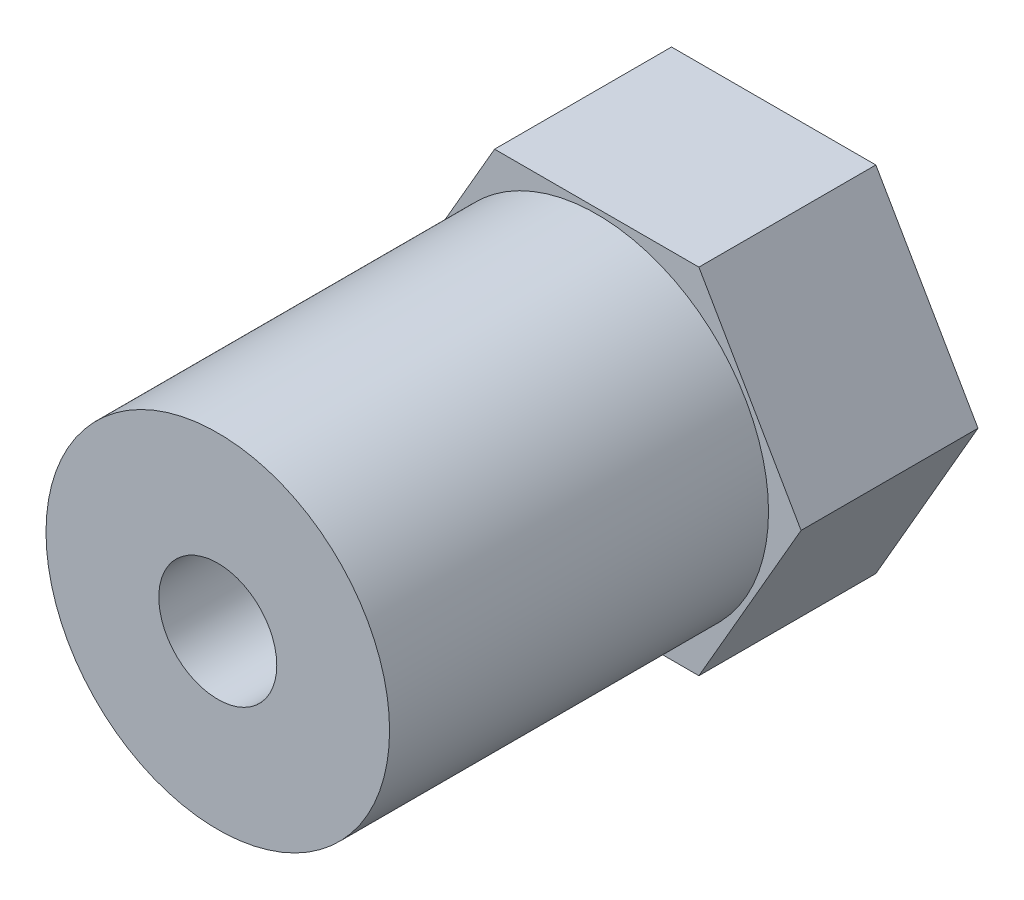
ISO-10303-21;
HEADER;
FILE_DESCRIPTION(('STEP AP214'),'2;1');
FILE_NAME('part.step','',(''),(''),'','','');
FILE_SCHEMA(('AUTOMOTIVE_DESIGN { 1 0 10303 214 1 1 1 1 }'));
ENDSEC;
DATA;
#1=APPLICATION_CONTEXT('core data for automotive mechanical design processes');
#2=APPLICATION_PROTOCOL_DEFINITION('international standard','automotive_design',2000,#1);
#3=PRODUCT_CONTEXT('',#1,'mechanical');
#4=PRODUCT('Part','Part','',(#3));
#5=PRODUCT_RELATED_PRODUCT_CATEGORY('part','',(#4));
#6=PRODUCT_DEFINITION_FORMATION('','',#4);
#7=PRODUCT_DEFINITION_CONTEXT('part definition',#1,'design');
#8=PRODUCT_DEFINITION('design','',#6,#7);
#9=PRODUCT_DEFINITION_SHAPE('','',#8);
#10=(LENGTH_UNIT() NAMED_UNIT(*) SI_UNIT(.MILLI.,.METRE.));
#11=(NAMED_UNIT(*) PLANE_ANGLE_UNIT() SI_UNIT($,.RADIAN.));
#12=(NAMED_UNIT(*) SI_UNIT($,.STERADIAN.) SOLID_ANGLE_UNIT());
#13=UNCERTAINTY_MEASURE_WITH_UNIT(LENGTH_MEASURE(1.E-05),#10,'distance_accuracy_value','');
#14=(GEOMETRIC_REPRESENTATION_CONTEXT(3) GLOBAL_UNCERTAINTY_ASSIGNED_CONTEXT((#13)) GLOBAL_UNIT_ASSIGNED_CONTEXT((#10,
#11,#12)) REPRESENTATION_CONTEXT('',''));
#15=CARTESIAN_POINT('',(0.,0.,0.));
#16=DIRECTION('',(0.,0.,1.));
#17=DIRECTION('',(1.,0.,0.));
#18=AXIS2_PLACEMENT_3D('',#15,#16,#17);
#19=CARTESIAN_POINT('',(0.,0.,6.));
#20=DIRECTION('',(0.,0.,1.));
#21=DIRECTION('',(1.,0.,0.));
#22=AXIS2_PLACEMENT_3D('',#19,#20,#21);
#23=PLANE('',#22);
#24=CARTESIAN_POINT('',(0.,0.,6.));
#25=DIRECTION('',(0.,0.,1.));
#26=DIRECTION('',(1.,0.,0.));
#27=AXIS2_PLACEMENT_3D('',#24,#25,#26);
#28=CIRCLE('',#27,1.625);
#29=CARTESIAN_POINT('',(1.625,0.,6.));
#30=VERTEX_POINT('',#29);
#31=EDGE_CURVE('E130',#30,#30,#28,.T.);
#32=ORIENTED_EDGE('',*,*,#31,.F.);
#33=EDGE_LOOP('',(#32));
#34=FACE_BOUND('',#33,.T.);
#35=CARTESIAN_POINT('',(0.,0.,6.));
#36=DIRECTION('',(0.,0.,1.));
#37=DIRECTION('',(1.,0.,0.));
#38=AXIS2_PLACEMENT_3D('',#35,#36,#37);
#39=CIRCLE('',#38,2.);
#40=CARTESIAN_POINT('',(2.,0.,6.));
#41=VERTEX_POINT('',#40);
#42=EDGE_CURVE('E165',#41,#41,#39,.T.);
#43=ORIENTED_EDGE('',*,*,#42,.T.);
#44=EDGE_LOOP('',(#43));
#45=FACE_BOUND('',#44,.T.);
#46=ADVANCED_FACE('F39',(#34,#45),#23,.T.);
#47=CARTESIAN_POINT('',(0.,0.,6.));
#48=DIRECTION('',(0.,0.,1.));
#49=DIRECTION('',(1.,0.,0.));
#50=AXIS2_PLACEMENT_3D('',#47,#48,#49);
#51=CIRCLE('',#50,5.825);
#52=CARTESIAN_POINT('',(5.825,0.,6.));
#53=VERTEX_POINT('',#52);
#54=EDGE_CURVE('E11',#53,#53,#51,.T.);
#55=ORIENTED_EDGE('',*,*,#54,.F.);
#56=EDGE_LOOP('',(#55));
#57=FACE_BOUND('',#56,.T.);
#58=DIRECTION('',(0.5,0.866025403784439,0.));
#59=VECTOR('',#58,1.);
#60=CARTESIAN_POINT('',(3.46410161513776,-6.,6.));
#61=LINE('',#60,#59);
#62=CARTESIAN_POINT('',(3.46410161513776,-6.,6.));
#63=VERTEX_POINT('',#62);
#64=CARTESIAN_POINT('',(6.92820323027551,0.,6.));
#65=VERTEX_POINT('',#64);
#66=EDGE_CURVE('E137',#63,#65,#61,.T.);
#67=ORIENTED_EDGE('',*,*,#66,.T.);
#68=DIRECTION('',(-0.5,0.866025403784438,0.));
#69=VECTOR('',#68,1.);
#70=CARTESIAN_POINT('',(6.92820323027551,0.,6.));
#71=LINE('',#70,#69);
#72=CARTESIAN_POINT('',(3.46410161513775,6.,6.));
#73=VERTEX_POINT('',#72);
#74=EDGE_CURVE('E95',#65,#73,#71,.T.);
#75=ORIENTED_EDGE('',*,*,#74,.T.);
#76=DIRECTION('',(-1.,0.,0.));
#77=VECTOR('',#76,1.);
#78=CARTESIAN_POINT('',(3.46410161513775,6.,6.));
#79=LINE('',#78,#77);
#80=CARTESIAN_POINT('',(-3.46410161513776,6.,6.));
#81=VERTEX_POINT('',#80);
#82=EDGE_CURVE('E108',#73,#81,#79,.T.);
#83=ORIENTED_EDGE('',*,*,#82,.T.);
#84=DIRECTION('',(-0.5,-0.866025403784439,0.));
#85=VECTOR('',#84,1.);
#86=CARTESIAN_POINT('',(-3.46410161513776,6.,6.));
#87=LINE('',#86,#85);
#88=CARTESIAN_POINT('',(-6.92820323027551,0.,6.));
#89=VERTEX_POINT('',#88);
#90=EDGE_CURVE('E102',#81,#89,#87,.T.);
#91=ORIENTED_EDGE('',*,*,#90,.T.);
#92=DIRECTION('',(0.5,-0.866025403784439,0.));
#93=VECTOR('',#92,1.);
#94=CARTESIAN_POINT('',(-6.92820323027551,0.,6.));
#95=LINE('',#94,#93);
#96=CARTESIAN_POINT('',(-3.46410161513776,-6.,6.));
#97=VERTEX_POINT('',#96);
#98=EDGE_CURVE('E106',#89,#97,#95,.T.);
#99=ORIENTED_EDGE('',*,*,#98,.T.);
#100=DIRECTION('',(1.,0.,0.));
#101=VECTOR('',#100,1.);
#102=CARTESIAN_POINT('',(-3.46410161513776,-6.,6.));
#103=LINE('',#102,#101);
#104=EDGE_CURVE('E57',#97,#63,#103,.T.);
#105=ORIENTED_EDGE('',*,*,#104,.T.);
#106=EDGE_LOOP('',(#67,#75,#83,#91,#99,#105));
#107=FACE_BOUND('',#106,.T.);
#108=ADVANCED_FACE('F104',(#57,#107),#23,.T.);
#109=CARTESIAN_POINT('',(0.,0.,0.));
#110=DIRECTION('',(0.,0.,1.));
#111=DIRECTION('',(1.,0.,0.));
#112=AXIS2_PLACEMENT_3D('',#109,#110,#111);
#113=PLANE('',#112);
#114=DIRECTION('',(0.5,0.866025403784439,0.));
#115=VECTOR('',#114,1.);
#116=CARTESIAN_POINT('',(3.46410161513776,-6.,0.));
#117=LINE('',#116,#115);
#118=CARTESIAN_POINT('',(3.46410161513776,-6.,0.));
#119=VERTEX_POINT('',#118);
#120=CARTESIAN_POINT('',(6.92820323027551,0.,0.));
#121=VERTEX_POINT('',#120);
#122=EDGE_CURVE('E126',#119,#121,#117,.T.);
#123=ORIENTED_EDGE('',*,*,#122,.F.);
#124=DIRECTION('',(1.,0.,0.));
#125=VECTOR('',#124,1.);
#126=CARTESIAN_POINT('',(-3.46410161513776,-6.,0.));
#127=LINE('',#126,#125);
#128=CARTESIAN_POINT('',(-3.46410161513776,-6.,0.));
#129=VERTEX_POINT('',#128);
#130=EDGE_CURVE('E86',#129,#119,#127,.T.);
#131=ORIENTED_EDGE('',*,*,#130,.F.);
#132=DIRECTION('',(0.5,-0.866025403784439,0.));
#133=VECTOR('',#132,1.);
#134=CARTESIAN_POINT('',(-6.92820323027551,0.,0.));
#135=LINE('',#134,#133);
#136=CARTESIAN_POINT('',(-6.92820323027551,0.,0.));
#137=VERTEX_POINT('',#136);
#138=EDGE_CURVE('E80',#137,#129,#135,.T.);
#139=ORIENTED_EDGE('',*,*,#138,.F.);
#140=DIRECTION('',(-0.5,-0.866025403784439,0.));
#141=VECTOR('',#140,1.);
#142=CARTESIAN_POINT('',(-3.46410161513776,6.,0.));
#143=LINE('',#142,#141);
#144=CARTESIAN_POINT('',(-3.46410161513776,6.,0.));
#145=VERTEX_POINT('',#144);
#146=EDGE_CURVE('E116',#145,#137,#143,.T.);
#147=ORIENTED_EDGE('',*,*,#146,.F.);
#148=DIRECTION('',(-1.,0.,0.));
#149=VECTOR('',#148,1.);
#150=CARTESIAN_POINT('',(3.46410161513775,6.,0.));
#151=LINE('',#150,#149);
#152=CARTESIAN_POINT('',(3.46410161513775,6.,0.));
#153=VERTEX_POINT('',#152);
#154=EDGE_CURVE('E132',#153,#145,#151,.T.);
#155=ORIENTED_EDGE('',*,*,#154,.F.);
#156=DIRECTION('',(-0.5,0.866025403784438,0.));
#157=VECTOR('',#156,1.);
#158=CARTESIAN_POINT('',(6.92820323027551,0.,0.));
#159=LINE('',#158,#157);
#160=EDGE_CURVE('E129',#121,#153,#159,.T.);
#161=ORIENTED_EDGE('',*,*,#160,.F.);
#162=EDGE_LOOP('',(#123,#131,#139,#147,#155,#161));
#163=FACE_BOUND('',#162,.T.);
#164=CARTESIAN_POINT('',(0.,0.,0.));
#165=DIRECTION('',(0.,0.,1.));
#166=DIRECTION('',(1.,0.,0.));
#167=AXIS2_PLACEMENT_3D('',#164,#165,#166);
#168=CIRCLE('',#167,1.625);
#169=CARTESIAN_POINT('',(1.625,0.,0.));
#170=VERTEX_POINT('',#169);
#171=EDGE_CURVE('E156',#170,#170,#168,.T.);
#172=ORIENTED_EDGE('',*,*,#171,.T.);
#173=EDGE_LOOP('',(#172));
#174=FACE_BOUND('',#173,.T.);
#175=ADVANCED_FACE('F150',(#163,#174),#113,.F.);
#176=CARTESIAN_POINT('',(3.46410161513776,-6.,6.));
#177=DIRECTION('',(-0.866025403784439,0.5,0.));
#178=DIRECTION('',(-0.5,-0.866025403784439,0.));
#179=AXIS2_PLACEMENT_3D('',#176,#177,#178);
#180=PLANE('',#179);
#181=ORIENTED_EDGE('',*,*,#122,.T.);
#182=DIRECTION('',(0.,0.,-1.));
#183=VECTOR('',#182,1.);
#184=CARTESIAN_POINT('',(6.92820323027551,0.,6.));
#185=LINE('',#184,#183);
#186=EDGE_CURVE('E43',#65,#121,#185,.T.);
#187=ORIENTED_EDGE('',*,*,#186,.F.);
#188=ORIENTED_EDGE('',*,*,#66,.F.);
#189=DIRECTION('',(0.,0.,-1.));
#190=VECTOR('',#189,1.);
#191=CARTESIAN_POINT('',(3.46410161513776,-6.,6.));
#192=LINE('',#191,#190);
#193=EDGE_CURVE('E122',#63,#119,#192,.T.);
#194=ORIENTED_EDGE('',*,*,#193,.T.);
#195=EDGE_LOOP('',(#181,#187,#188,#194));
#196=FACE_BOUND('',#195,.T.);
#197=ADVANCED_FACE('F41',(#196),#180,.F.);
#198=CARTESIAN_POINT('',(6.92820323027551,0.,6.));
#199=DIRECTION('',(-0.866025403784438,-0.5,0.));
#200=DIRECTION('',(0.5,-0.866025403784438,0.));
#201=AXIS2_PLACEMENT_3D('',#198,#199,#200);
#202=PLANE('',#201);
#203=ORIENTED_EDGE('',*,*,#160,.T.);
#204=DIRECTION('',(0.,0.,-1.));
#205=VECTOR('',#204,1.);
#206=CARTESIAN_POINT('',(3.46410161513775,6.,6.));
#207=LINE('',#206,#205);
#208=EDGE_CURVE('E140',#73,#153,#207,.T.);
#209=ORIENTED_EDGE('',*,*,#208,.F.);
#210=ORIENTED_EDGE('',*,*,#74,.F.);
#211=ORIENTED_EDGE('',*,*,#186,.T.);
#212=EDGE_LOOP('',(#203,#209,#210,#211));
#213=FACE_BOUND('',#212,.T.);
#214=ADVANCED_FACE('F145',(#213),#202,.F.);
#215=CARTESIAN_POINT('',(3.46410161513775,6.,6.));
#216=DIRECTION('',(0.,-1.,0.));
#217=DIRECTION('',(0.,0.,-1.));
#218=AXIS2_PLACEMENT_3D('',#215,#216,#217);
#219=PLANE('',#218);
#220=ORIENTED_EDGE('',*,*,#154,.T.);
#221=DIRECTION('',(0.,0.,-1.));
#222=VECTOR('',#221,1.);
#223=CARTESIAN_POINT('',(-3.46410161513776,6.,6.));
#224=LINE('',#223,#222);
#225=EDGE_CURVE('E117',#81,#145,#224,.T.);
#226=ORIENTED_EDGE('',*,*,#225,.F.);
#227=ORIENTED_EDGE('',*,*,#82,.F.);
#228=ORIENTED_EDGE('',*,*,#208,.T.);
#229=EDGE_LOOP('',(#220,#226,#227,#228));
#230=FACE_BOUND('',#229,.T.);
#231=ADVANCED_FACE('F152',(#230),#219,.F.);
#232=CARTESIAN_POINT('',(-3.46410161513776,6.,6.));
#233=DIRECTION('',(0.866025403784439,-0.5,0.));
#234=DIRECTION('',(0.5,0.866025403784439,0.));
#235=AXIS2_PLACEMENT_3D('',#232,#233,#234);
#236=PLANE('',#235);
#237=ORIENTED_EDGE('',*,*,#146,.T.);
#238=DIRECTION('',(0.,0.,-1.));
#239=VECTOR('',#238,1.);
#240=CARTESIAN_POINT('',(-6.92820323027551,0.,6.));
#241=LINE('',#240,#239);
#242=EDGE_CURVE('E113',#89,#137,#241,.T.);
#243=ORIENTED_EDGE('',*,*,#242,.F.);
#244=ORIENTED_EDGE('',*,*,#90,.F.);
#245=ORIENTED_EDGE('',*,*,#225,.T.);
#246=EDGE_LOOP('',(#237,#243,#244,#245));
#247=FACE_BOUND('',#246,.T.);
#248=ADVANCED_FACE('F114',(#247),#236,.F.);
#249=CARTESIAN_POINT('',(-6.92820323027551,0.,6.));
#250=DIRECTION('',(0.866025403784439,0.5,0.));
#251=DIRECTION('',(-0.5,0.866025403784439,0.));
#252=AXIS2_PLACEMENT_3D('',#249,#250,#251);
#253=PLANE('',#252);
#254=ORIENTED_EDGE('',*,*,#138,.T.);
#255=DIRECTION('',(0.,0.,-1.));
#256=VECTOR('',#255,1.);
#257=CARTESIAN_POINT('',(-3.46410161513776,-6.,6.));
#258=LINE('',#257,#256);
#259=EDGE_CURVE('E118',#97,#129,#258,.T.);
#260=ORIENTED_EDGE('',*,*,#259,.F.);
#261=ORIENTED_EDGE('',*,*,#98,.F.);
#262=ORIENTED_EDGE('',*,*,#242,.T.);
#263=EDGE_LOOP('',(#254,#260,#261,#262));
#264=FACE_BOUND('',#263,.T.);
#265=ADVANCED_FACE('F120',(#264),#253,.F.);
#266=CARTESIAN_POINT('',(-3.46410161513776,-6.,6.));
#267=DIRECTION('',(0.,1.,0.));
#268=DIRECTION('',(0.,0.,1.));
#269=AXIS2_PLACEMENT_3D('',#266,#267,#268);
#270=PLANE('',#269);
#271=ORIENTED_EDGE('',*,*,#130,.T.);
#272=ORIENTED_EDGE('',*,*,#193,.F.);
#273=ORIENTED_EDGE('',*,*,#104,.F.);
#274=ORIENTED_EDGE('',*,*,#259,.T.);
#275=EDGE_LOOP('',(#271,#272,#273,#274));
#276=FACE_BOUND('',#275,.T.);
#277=ADVANCED_FACE('F186',(#276),#270,.F.);
#278=CARTESIAN_POINT('',(0.,0.,6.));
#279=DIRECTION('',(0.,0.,-1.));
#280=DIRECTION('',(-1.,0.,0.));
#281=AXIS2_PLACEMENT_3D('',#278,#279,#280);
#282=CYLINDRICAL_SURFACE('',#281,1.625);
#283=ORIENTED_EDGE('',*,*,#31,.T.);
#284=EDGE_LOOP('',(#283));
#285=FACE_BOUND('',#284,.T.);
#286=ORIENTED_EDGE('',*,*,#171,.F.);
#287=EDGE_LOOP('',(#286));
#288=FACE_BOUND('',#287,.T.);
#289=ADVANCED_FACE('F177',(#285,#288),#282,.F.);
#290=CARTESIAN_POINT('',(0.,0.,18.85));
#291=DIRECTION('',(0.,0.,1.));
#292=DIRECTION('',(1.,0.,0.));
#293=AXIS2_PLACEMENT_3D('',#290,#291,#292);
#294=PLANE('',#293);
#295=CARTESIAN_POINT('',(0.,0.,18.85));
#296=DIRECTION('',(0.,0.,1.));
#297=DIRECTION('',(1.,0.,0.));
#298=AXIS2_PLACEMENT_3D('',#295,#296,#297);
#299=CIRCLE('',#298,5.825);
#300=CARTESIAN_POINT('',(5.825,0.,18.85));
#301=VERTEX_POINT('',#300);
#302=EDGE_CURVE('E159',#301,#301,#299,.T.);
#303=ORIENTED_EDGE('',*,*,#302,.T.);
#304=EDGE_LOOP('',(#303));
#305=FACE_BOUND('',#304,.T.);
#306=CARTESIAN_POINT('',(0.,0.,18.85));
#307=DIRECTION('',(0.,0.,1.));
#308=DIRECTION('',(1.,0.,0.));
#309=AXIS2_PLACEMENT_3D('',#306,#307,#308);
#310=CIRCLE('',#309,2.);
#311=CARTESIAN_POINT('',(2.,0.,18.85));
#312=VERTEX_POINT('',#311);
#313=EDGE_CURVE('E164',#312,#312,#310,.T.);
#314=ORIENTED_EDGE('',*,*,#313,.F.);
#315=EDGE_LOOP('',(#314));
#316=FACE_BOUND('',#315,.T.);
#317=ADVANCED_FACE('F174',(#305,#316),#294,.T.);
#318=CARTESIAN_POINT('',(0.,0.,18.85));
#319=DIRECTION('',(0.,0.,-1.));
#320=DIRECTION('',(-1.,0.,0.));
#321=AXIS2_PLACEMENT_3D('',#318,#319,#320);
#322=CYLINDRICAL_SURFACE('',#321,5.825);
#323=ORIENTED_EDGE('',*,*,#302,.F.);
#324=EDGE_LOOP('',(#323));
#325=FACE_BOUND('',#324,.T.);
#326=ORIENTED_EDGE('',*,*,#54,.T.);
#327=EDGE_LOOP('',(#326));
#328=FACE_BOUND('',#327,.T.);
#329=ADVANCED_FACE('F176',(#325,#328),#322,.T.);
#330=CARTESIAN_POINT('',(0.,0.,18.85));
#331=DIRECTION('',(0.,0.,-1.));
#332=DIRECTION('',(-1.,0.,0.));
#333=AXIS2_PLACEMENT_3D('',#330,#331,#332);
#334=CYLINDRICAL_SURFACE('',#333,2.);
#335=ORIENTED_EDGE('',*,*,#313,.T.);
#336=EDGE_LOOP('',(#335));
#337=FACE_BOUND('',#336,.T.);
#338=ORIENTED_EDGE('',*,*,#42,.F.);
#339=EDGE_LOOP('',(#338));
#340=FACE_BOUND('',#339,.T.);
#341=ADVANCED_FACE('F171',(#337,#340),#334,.F.);
#342=CLOSED_SHELL('',(#46,#108,#175,#197,#214,#231,#248,#265,#277,#289,#317,#329,#341));
#343=MANIFOLD_SOLID_BREP('B2',#342);
#344=ADVANCED_BREP_SHAPE_REPRESENTATION('',(#18,#343),#14);
#345=SHAPE_DEFINITION_REPRESENTATION(#9,#344);
ENDSEC;
END-ISO-10303-21;
